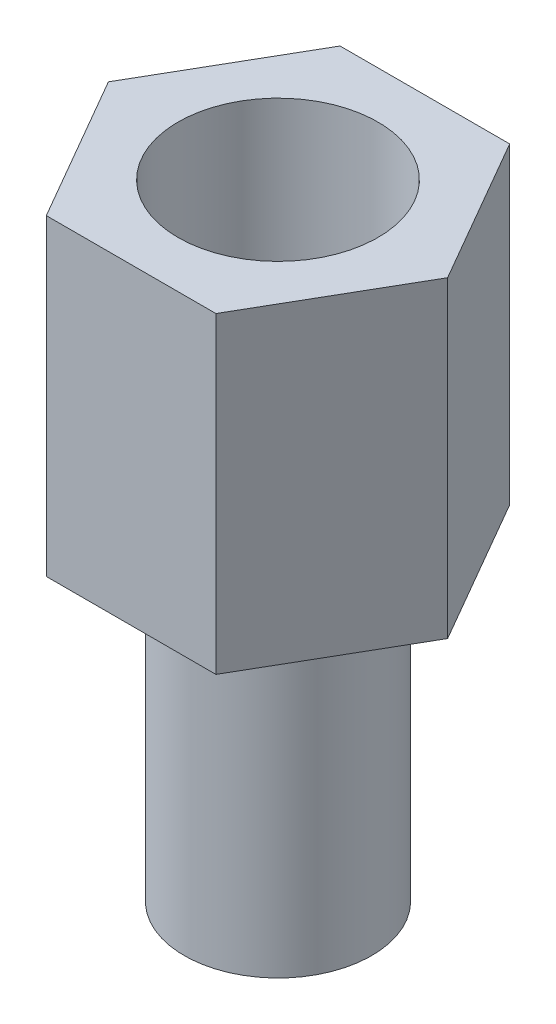
ISO-10303-21;
HEADER;
FILE_DESCRIPTION(('STEP AP214'),'2;1');
FILE_NAME('part.step','',(''),(''),'','','');
FILE_SCHEMA(('AUTOMOTIVE_DESIGN { 1 0 10303 214 1 1 1 1 }'));
ENDSEC;
DATA;
#1=APPLICATION_CONTEXT('core data for automotive mechanical design processes');
#2=APPLICATION_PROTOCOL_DEFINITION('international standard','automotive_design',2000,#1);
#3=PRODUCT_CONTEXT('',#1,'mechanical');
#4=PRODUCT('Part','Part','',(#3));
#5=PRODUCT_RELATED_PRODUCT_CATEGORY('part','',(#4));
#6=PRODUCT_DEFINITION_FORMATION('','',#4);
#7=PRODUCT_DEFINITION_CONTEXT('part definition',#1,'design');
#8=PRODUCT_DEFINITION('design','',#6,#7);
#9=PRODUCT_DEFINITION_SHAPE('','',#8);
#10=(LENGTH_UNIT() NAMED_UNIT(*) SI_UNIT(.MILLI.,.METRE.));
#11=(NAMED_UNIT(*) PLANE_ANGLE_UNIT() SI_UNIT($,.RADIAN.));
#12=(NAMED_UNIT(*) SI_UNIT($,.STERADIAN.) SOLID_ANGLE_UNIT());
#13=UNCERTAINTY_MEASURE_WITH_UNIT(LENGTH_MEASURE(1.E-05),#10,'distance_accuracy_value','');
#14=(GEOMETRIC_REPRESENTATION_CONTEXT(3) GLOBAL_UNCERTAINTY_ASSIGNED_CONTEXT((#13)) GLOBAL_UNIT_ASSIGNED_CONTEXT((#10,
#11,#12)) REPRESENTATION_CONTEXT('',''));
#15=CARTESIAN_POINT('',(0.,0.,0.));
#16=DIRECTION('',(0.,0.,1.));
#17=DIRECTION('',(1.,0.,0.));
#18=AXIS2_PLACEMENT_3D('',#15,#16,#17);
#19=CARTESIAN_POINT('',(1.35677313259562,5.,2.35));
#20=DIRECTION('',(-0.866025403784439,0.,-0.5));
#21=DIRECTION('',(-0.5,0.,0.866025403784439));
#22=AXIS2_PLACEMENT_3D('',#19,#20,#21);
#23=PLANE('',#22);
#24=DIRECTION('',(0.5,0.,-0.866025403784439));
#25=VECTOR('',#24,1.);
#26=CARTESIAN_POINT('',(1.35677313259562,0.,2.35));
#27=LINE('',#26,#25);
#28=CARTESIAN_POINT('',(1.35677313259562,0.,2.35));
#29=VERTEX_POINT('',#28);
#30=CARTESIAN_POINT('',(2.71354626519124,0.,0.));
#31=VERTEX_POINT('',#30);
#32=EDGE_CURVE('E123',#29,#31,#27,.T.);
#33=ORIENTED_EDGE('',*,*,#32,.T.);
#34=DIRECTION('',(0.,-1.,0.));
#35=VECTOR('',#34,1.);
#36=CARTESIAN_POINT('',(2.71354626519124,5.,0.));
#37=LINE('',#36,#35);
#38=CARTESIAN_POINT('',(2.71354626519124,5.,0.));
#39=VERTEX_POINT('',#38);
#40=EDGE_CURVE('E40',#39,#31,#37,.T.);
#41=ORIENTED_EDGE('',*,*,#40,.F.);
#42=DIRECTION('',(0.5,0.,-0.866025403784439));
#43=VECTOR('',#42,1.);
#44=CARTESIAN_POINT('',(1.35677313259562,5.,2.35));
#45=LINE('',#44,#43);
#46=CARTESIAN_POINT('',(1.35677313259562,5.,2.35));
#47=VERTEX_POINT('',#46);
#48=EDGE_CURVE('E134',#47,#39,#45,.T.);
#49=ORIENTED_EDGE('',*,*,#48,.F.);
#50=DIRECTION('',(0.,-1.,0.));
#51=VECTOR('',#50,1.);
#52=CARTESIAN_POINT('',(1.35677313259562,5.,2.35));
#53=LINE('',#52,#51);
#54=EDGE_CURVE('E119',#47,#29,#53,.T.);
#55=ORIENTED_EDGE('',*,*,#54,.T.);
#56=EDGE_LOOP('',(#33,#41,#49,#55));
#57=FACE_BOUND('',#56,.T.);
#58=ADVANCED_FACE('F37',(#57),#23,.F.);
#59=CARTESIAN_POINT('',(2.71354626519124,5.,0.));
#60=DIRECTION('',(-0.866025403784439,0.,0.5));
#61=DIRECTION('',(0.5,0.,0.866025403784439));
#62=AXIS2_PLACEMENT_3D('',#59,#60,#61);
#63=PLANE('',#62);
#64=DIRECTION('',(-0.5,0.,-0.866025403784439));
#65=VECTOR('',#64,1.);
#66=CARTESIAN_POINT('',(2.71354626519124,0.,0.));
#67=LINE('',#66,#65);
#68=CARTESIAN_POINT('',(1.35677313259562,0.,-2.35));
#69=VERTEX_POINT('',#68);
#70=EDGE_CURVE('E126',#31,#69,#67,.T.);
#71=ORIENTED_EDGE('',*,*,#70,.T.);
#72=DIRECTION('',(0.,-1.,0.));
#73=VECTOR('',#72,1.);
#74=CARTESIAN_POINT('',(1.35677313259562,5.,-2.35));
#75=LINE('',#74,#73);
#76=CARTESIAN_POINT('',(1.35677313259562,5.,-2.35));
#77=VERTEX_POINT('',#76);
#78=EDGE_CURVE('E137',#77,#69,#75,.T.);
#79=ORIENTED_EDGE('',*,*,#78,.F.);
#80=DIRECTION('',(-0.5,0.,-0.866025403784439));
#81=VECTOR('',#80,1.);
#82=CARTESIAN_POINT('',(2.71354626519124,5.,0.));
#83=LINE('',#82,#81);
#84=EDGE_CURVE('E92',#39,#77,#83,.T.);
#85=ORIENTED_EDGE('',*,*,#84,.F.);
#86=ORIENTED_EDGE('',*,*,#40,.T.);
#87=EDGE_LOOP('',(#71,#79,#85,#86));
#88=FACE_BOUND('',#87,.T.);
#89=ADVANCED_FACE('F142',(#88),#63,.F.);
#90=CARTESIAN_POINT('',(1.35677313259562,5.,-2.35));
#91=DIRECTION('',(0.,0.,1.));
#92=DIRECTION('',(1.,0.,0.));
#93=AXIS2_PLACEMENT_3D('',#90,#91,#92);
#94=PLANE('',#93);
#95=DIRECTION('',(-1.,0.,0.));
#96=VECTOR('',#95,1.);
#97=CARTESIAN_POINT('',(1.35677313259562,0.,-2.35));
#98=LINE('',#97,#96);
#99=CARTESIAN_POINT('',(-1.35677313259562,0.,-2.35));
#100=VERTEX_POINT('',#99);
#101=EDGE_CURVE('E129',#69,#100,#98,.T.);
#102=ORIENTED_EDGE('',*,*,#101,.T.);
#103=DIRECTION('',(0.,-1.,0.));
#104=VECTOR('',#103,1.);
#105=CARTESIAN_POINT('',(-1.35677313259562,5.,-2.35));
#106=LINE('',#105,#104);
#107=CARTESIAN_POINT('',(-1.35677313259562,5.,-2.35));
#108=VERTEX_POINT('',#107);
#109=EDGE_CURVE('E114',#108,#100,#106,.T.);
#110=ORIENTED_EDGE('',*,*,#109,.F.);
#111=DIRECTION('',(-1.,0.,0.));
#112=VECTOR('',#111,1.);
#113=CARTESIAN_POINT('',(1.35677313259562,5.,-2.35));
#114=LINE('',#113,#112);
#115=EDGE_CURVE('E105',#77,#108,#114,.T.);
#116=ORIENTED_EDGE('',*,*,#115,.F.);
#117=ORIENTED_EDGE('',*,*,#78,.T.);
#118=EDGE_LOOP('',(#102,#110,#116,#117));
#119=FACE_BOUND('',#118,.T.);
#120=ADVANCED_FACE('F148',(#119),#94,.F.);
#121=CARTESIAN_POINT('',(-1.35677313259562,5.,-2.35));
#122=DIRECTION('',(0.866025403784439,0.,0.5));
#123=DIRECTION('',(0.5,0.,-0.866025403784439));
#124=AXIS2_PLACEMENT_3D('',#121,#122,#123);
#125=PLANE('',#124);
#126=DIRECTION('',(-0.5,0.,0.866025403784439));
#127=VECTOR('',#126,1.);
#128=CARTESIAN_POINT('',(-1.35677313259562,0.,-2.35));
#129=LINE('',#128,#127);
#130=CARTESIAN_POINT('',(-2.71354626519124,0.,0.));
#131=VERTEX_POINT('',#130);
#132=EDGE_CURVE('E113',#100,#131,#129,.T.);
#133=ORIENTED_EDGE('',*,*,#132,.T.);
#134=DIRECTION('',(0.,-1.,0.));
#135=VECTOR('',#134,1.);
#136=CARTESIAN_POINT('',(-2.71354626519124,5.,0.));
#137=LINE('',#136,#135);
#138=CARTESIAN_POINT('',(-2.71354626519124,5.,0.));
#139=VERTEX_POINT('',#138);
#140=EDGE_CURVE('E110',#139,#131,#137,.T.);
#141=ORIENTED_EDGE('',*,*,#140,.F.);
#142=DIRECTION('',(-0.5,0.,0.866025403784439));
#143=VECTOR('',#142,1.);
#144=CARTESIAN_POINT('',(-1.35677313259562,5.,-2.35));
#145=LINE('',#144,#143);
#146=EDGE_CURVE('E99',#108,#139,#145,.T.);
#147=ORIENTED_EDGE('',*,*,#146,.F.);
#148=ORIENTED_EDGE('',*,*,#109,.T.);
#149=EDGE_LOOP('',(#133,#141,#147,#148));
#150=FACE_BOUND('',#149,.T.);
#151=ADVANCED_FACE('F111',(#150),#125,.F.);
#152=CARTESIAN_POINT('',(-2.71354626519124,5.,0.));
#153=DIRECTION('',(0.866025403784439,0.,-0.5));
#154=DIRECTION('',(-0.5,0.,-0.866025403784439));
#155=AXIS2_PLACEMENT_3D('',#152,#153,#154);
#156=PLANE('',#155);
#157=DIRECTION('',(0.5,0.,0.866025403784439));
#158=VECTOR('',#157,1.);
#159=CARTESIAN_POINT('',(-2.71354626519124,0.,0.));
#160=LINE('',#159,#158);
#161=CARTESIAN_POINT('',(-1.35677313259562,0.,2.35));
#162=VERTEX_POINT('',#161);
#163=EDGE_CURVE('E77',#131,#162,#160,.T.);
#164=ORIENTED_EDGE('',*,*,#163,.T.);
#165=DIRECTION('',(0.,-1.,0.));
#166=VECTOR('',#165,1.);
#167=CARTESIAN_POINT('',(-1.35677313259562,5.,2.35));
#168=LINE('',#167,#166);
#169=CARTESIAN_POINT('',(-1.35677313259562,5.,2.35));
#170=VERTEX_POINT('',#169);
#171=EDGE_CURVE('E115',#170,#162,#168,.T.);
#172=ORIENTED_EDGE('',*,*,#171,.F.);
#173=DIRECTION('',(0.5,0.,0.866025403784439));
#174=VECTOR('',#173,1.);
#175=CARTESIAN_POINT('',(-2.71354626519124,5.,0.));
#176=LINE('',#175,#174);
#177=EDGE_CURVE('E103',#139,#170,#176,.T.);
#178=ORIENTED_EDGE('',*,*,#177,.F.);
#179=ORIENTED_EDGE('',*,*,#140,.T.);
#180=EDGE_LOOP('',(#164,#172,#178,#179));
#181=FACE_BOUND('',#180,.T.);
#182=ADVANCED_FACE('F117',(#181),#156,.F.);
#183=CARTESIAN_POINT('',(-1.35677313259562,5.,2.35));
#184=DIRECTION('',(0.,0.,-1.));
#185=DIRECTION('',(-1.,0.,0.));
#186=AXIS2_PLACEMENT_3D('',#183,#184,#185);
#187=PLANE('',#186);
#188=DIRECTION('',(1.,0.,0.));
#189=VECTOR('',#188,1.);
#190=CARTESIAN_POINT('',(-1.35677313259562,0.,2.35));
#191=LINE('',#190,#189);
#192=EDGE_CURVE('E83',#162,#29,#191,.T.);
#193=ORIENTED_EDGE('',*,*,#192,.T.);
#194=ORIENTED_EDGE('',*,*,#54,.F.);
#195=DIRECTION('',(1.,0.,0.));
#196=VECTOR('',#195,1.);
#197=CARTESIAN_POINT('',(-1.35677313259562,5.,2.35));
#198=LINE('',#197,#196);
#199=EDGE_CURVE('E54',#170,#47,#198,.T.);
#200=ORIENTED_EDGE('',*,*,#199,.F.);
#201=ORIENTED_EDGE('',*,*,#171,.T.);
#202=EDGE_LOOP('',(#193,#194,#200,#201));
#203=FACE_BOUND('',#202,.T.);
#204=ADVANCED_FACE('F179',(#203),#187,.F.);
#205=CARTESIAN_POINT('',(0.,5.,0.));
#206=DIRECTION('',(0.,1.,0.));
#207=DIRECTION('',(0.,0.,1.));
#208=AXIS2_PLACEMENT_3D('',#205,#206,#207);
#209=PLANE('',#208);
#210=CARTESIAN_POINT('',(0.,5.,0.));
#211=DIRECTION('',(0.,1.,0.));
#212=DIRECTION('',(0.,0.,1.));
#213=AXIS2_PLACEMENT_3D('',#210,#211,#212);
#214=CIRCLE('',#213,1.6);
#215=CARTESIAN_POINT('',(0.,5.,1.6));
#216=VERTEX_POINT('',#215);
#217=EDGE_CURVE('E154',#216,#216,#214,.T.);
#218=ORIENTED_EDGE('',*,*,#217,.F.);
#219=EDGE_LOOP('',(#218));
#220=FACE_BOUND('',#219,.T.);
#221=ORIENTED_EDGE('',*,*,#48,.T.);
#222=ORIENTED_EDGE('',*,*,#84,.T.);
#223=ORIENTED_EDGE('',*,*,#115,.T.);
#224=ORIENTED_EDGE('',*,*,#146,.T.);
#225=ORIENTED_EDGE('',*,*,#177,.T.);
#226=ORIENTED_EDGE('',*,*,#199,.T.);
#227=EDGE_LOOP('',(#221,#222,#223,#224,#225,#226));
#228=FACE_BOUND('',#227,.T.);
#229=ADVANCED_FACE('F101',(#220,#228),#209,.T.);
#230=CARTESIAN_POINT('',(0.,0.,0.));
#231=DIRECTION('',(0.,1.,0.));
#232=DIRECTION('',(0.,0.,1.));
#233=AXIS2_PLACEMENT_3D('',#230,#231,#232);
#234=PLANE('',#233);
#235=CARTESIAN_POINT('',(0.,0.,0.));
#236=DIRECTION('',(0.,-1.,0.));
#237=DIRECTION('',(0.,0.,-1.));
#238=AXIS2_PLACEMENT_3D('',#235,#236,#237);
#239=CIRCLE('',#238,1.5);
#240=CARTESIAN_POINT('',(0.,0.,-1.5));
#241=VERTEX_POINT('',#240);
#242=EDGE_CURVE('E12',#241,#241,#239,.T.);
#243=ORIENTED_EDGE('',*,*,#242,.F.);
#244=EDGE_LOOP('',(#243));
#245=FACE_BOUND('',#244,.T.);
#246=ORIENTED_EDGE('',*,*,#32,.F.);
#247=ORIENTED_EDGE('',*,*,#192,.F.);
#248=ORIENTED_EDGE('',*,*,#163,.F.);
#249=ORIENTED_EDGE('',*,*,#132,.F.);
#250=ORIENTED_EDGE('',*,*,#101,.F.);
#251=ORIENTED_EDGE('',*,*,#70,.F.);
#252=EDGE_LOOP('',(#246,#247,#248,#249,#250,#251));
#253=FACE_BOUND('',#252,.T.);
#254=ADVANCED_FACE('F147',(#245,#253),#234,.F.);
#255=CARTESIAN_POINT('',(0.,-4.5254833995939,0.));
#256=DIRECTION('',(0.,1.,0.));
#257=DIRECTION('',(0.,0.,1.));
#258=AXIS2_PLACEMENT_3D('',#255,#256,#257);
#259=CYLINDRICAL_SURFACE('',#258,1.6);
#260=CARTESIAN_POINT('',(0.,1.,0.));
#261=DIRECTION('',(0.,1.,0.));
#262=DIRECTION('',(0.,0.,1.));
#263=AXIS2_PLACEMENT_3D('',#260,#261,#262);
#264=CIRCLE('',#263,1.6);
#265=CARTESIAN_POINT('',(0.,1.,1.6));
#266=VERTEX_POINT('',#265);
#267=EDGE_CURVE('E127',#266,#266,#264,.F.);
#268=ORIENTED_EDGE('',*,*,#267,.T.);
#269=EDGE_LOOP('',(#268));
#270=FACE_BOUND('',#269,.T.);
#271=ORIENTED_EDGE('',*,*,#217,.T.);
#272=EDGE_LOOP('',(#271));
#273=FACE_BOUND('',#272,.T.);
#274=ADVANCED_FACE('F171',(#270,#273),#259,.F.);
#275=CARTESIAN_POINT('',(0.,1.,0.));
#276=DIRECTION('',(0.,1.,0.));
#277=DIRECTION('',(0.,0.,1.));
#278=AXIS2_PLACEMENT_3D('',#275,#276,#277);
#279=PLANE('',#278);
#280=ORIENTED_EDGE('',*,*,#267,.F.);
#281=EDGE_LOOP('',(#280));
#282=FACE_BOUND('',#281,.T.);
#283=ADVANCED_FACE('F166',(#282),#279,.T.);
#284=CARTESIAN_POINT('',(0.,-5.,0.));
#285=DIRECTION('',(0.,1.,0.));
#286=DIRECTION('',(0.,0.,1.));
#287=AXIS2_PLACEMENT_3D('',#284,#285,#286);
#288=CYLINDRICAL_SURFACE('',#287,1.5);
#289=CARTESIAN_POINT('',(0.,-5.,0.));
#290=DIRECTION('',(0.,-1.,0.));
#291=DIRECTION('',(0.,0.,-1.));
#292=AXIS2_PLACEMENT_3D('',#289,#290,#291);
#293=CIRCLE('',#292,1.5);
#294=CARTESIAN_POINT('',(0.,-5.,-1.5));
#295=VERTEX_POINT('',#294);
#296=EDGE_CURVE('E156',#295,#295,#293,.T.);
#297=ORIENTED_EDGE('',*,*,#296,.F.);
#298=EDGE_LOOP('',(#297));
#299=FACE_BOUND('',#298,.T.);
#300=ORIENTED_EDGE('',*,*,#242,.T.);
#301=EDGE_LOOP('',(#300));
#302=FACE_BOUND('',#301,.T.);
#303=ADVANCED_FACE('F163',(#299,#302),#288,.T.);
#304=CARTESIAN_POINT('',(0.,-5.,0.));
#305=DIRECTION('',(0.,-1.,0.));
#306=DIRECTION('',(0.,0.,-1.));
#307=AXIS2_PLACEMENT_3D('',#304,#305,#306);
#308=PLANE('',#307);
#309=ORIENTED_EDGE('',*,*,#296,.T.);
#310=EDGE_LOOP('',(#309));
#311=FACE_BOUND('',#310,.T.);
#312=ADVANCED_FACE('F161',(#311),#308,.T.);
#313=CLOSED_SHELL('',(#58,#89,#120,#151,#182,#204,#229,#254,#274,#283,#303,#312));
#314=MANIFOLD_SOLID_BREP('B2',#313);
#315=ADVANCED_BREP_SHAPE_REPRESENTATION('',(#18,#314),#14);
#316=SHAPE_DEFINITION_REPRESENTATION(#9,#315);
ENDSEC;
END-ISO-10303-21;
